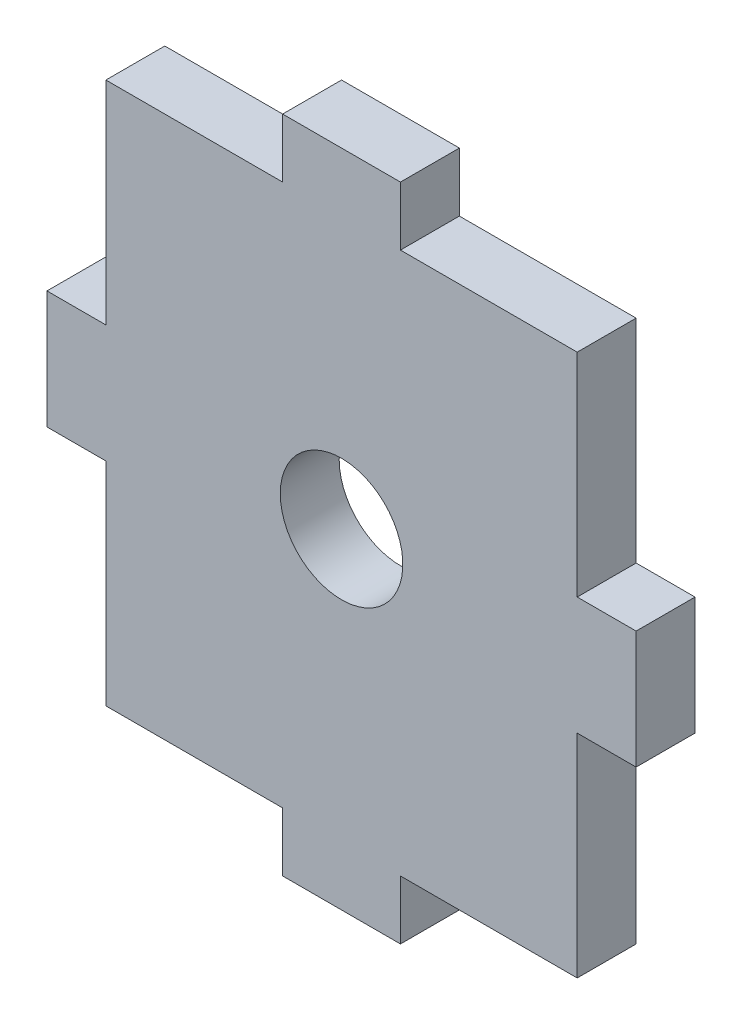
ISO-10303-21;
HEADER;
FILE_DESCRIPTION(('STEP AP214'),'2;1');
FILE_NAME('part.step','',(''),(''),'','','');
FILE_SCHEMA(('AUTOMOTIVE_DESIGN { 1 0 10303 214 1 1 1 1 }'));
ENDSEC;
DATA;
#1=APPLICATION_CONTEXT('core data for automotive mechanical design processes');
#2=APPLICATION_PROTOCOL_DEFINITION('international standard','automotive_design',2000,#1);
#3=PRODUCT_CONTEXT('',#1,'mechanical');
#4=PRODUCT('Part','Part','',(#3));
#5=PRODUCT_RELATED_PRODUCT_CATEGORY('part','',(#4));
#6=PRODUCT_DEFINITION_FORMATION('','',#4);
#7=PRODUCT_DEFINITION_CONTEXT('part definition',#1,'design');
#8=PRODUCT_DEFINITION('design','',#6,#7);
#9=PRODUCT_DEFINITION_SHAPE('','',#8);
#10=(LENGTH_UNIT() NAMED_UNIT(*) SI_UNIT(.MILLI.,.METRE.));
#11=(NAMED_UNIT(*) PLANE_ANGLE_UNIT() SI_UNIT($,.RADIAN.));
#12=(NAMED_UNIT(*) SI_UNIT($,.STERADIAN.) SOLID_ANGLE_UNIT());
#13=UNCERTAINTY_MEASURE_WITH_UNIT(LENGTH_MEASURE(1.E-05),#10,'distance_accuracy_value','');
#14=(GEOMETRIC_REPRESENTATION_CONTEXT(3) GLOBAL_UNCERTAINTY_ASSIGNED_CONTEXT((#13)) GLOBAL_UNIT_ASSIGNED_CONTEXT((#10,
#11,#12)) REPRESENTATION_CONTEXT('',''));
#15=CARTESIAN_POINT('',(0.,0.,0.));
#16=DIRECTION('',(0.,0.,1.));
#17=DIRECTION('',(1.,0.,0.));
#18=AXIS2_PLACEMENT_3D('',#15,#16,#17);
#19=CARTESIAN_POINT('',(-12.7,14.605,3.175));
#20=DIRECTION('',(1.,0.,0.));
#21=DIRECTION('',(0.,0.,-1.));
#22=AXIS2_PLACEMENT_3D('',#19,#20,#21);
#23=PLANE('',#22);
#24=DIRECTION('',(0.,-1.,0.));
#25=VECTOR('',#24,1.);
#26=CARTESIAN_POINT('',(-12.7,14.605,0.));
#27=LINE('',#26,#25);
#28=CARTESIAN_POINT('',(-12.7,14.605,0.));
#29=VERTEX_POINT('',#28);
#30=CARTESIAN_POINT('',(-12.7,3.175,0.));
#31=VERTEX_POINT('',#30);
#32=EDGE_CURVE('E200',#29,#31,#27,.T.);
#33=ORIENTED_EDGE('',*,*,#32,.T.);
#34=DIRECTION('',(0.,0.,-1.));
#35=VECTOR('',#34,1.);
#36=CARTESIAN_POINT('',(-12.7,3.175,3.175));
#37=LINE('',#36,#35);
#38=CARTESIAN_POINT('',(-12.7,3.175,3.175));
#39=VERTEX_POINT('',#38);
#40=EDGE_CURVE('E11',#39,#31,#37,.T.);
#41=ORIENTED_EDGE('',*,*,#40,.F.);
#42=DIRECTION('',(0.,-1.,0.));
#43=VECTOR('',#42,1.);
#44=CARTESIAN_POINT('',(-12.7,14.605,3.175));
#45=LINE('',#44,#43);
#46=CARTESIAN_POINT('',(-12.7,14.605,3.175));
#47=VERTEX_POINT('',#46);
#48=EDGE_CURVE('E239',#47,#39,#45,.T.);
#49=ORIENTED_EDGE('',*,*,#48,.F.);
#50=DIRECTION('',(0.,0.,-1.));
#51=VECTOR('',#50,1.);
#52=CARTESIAN_POINT('',(-12.7,14.605,3.175));
#53=LINE('',#52,#51);
#54=EDGE_CURVE('E196',#47,#29,#53,.T.);
#55=ORIENTED_EDGE('',*,*,#54,.T.);
#56=EDGE_LOOP('',(#33,#41,#49,#55));
#57=FACE_BOUND('',#56,.T.);
#58=ADVANCED_FACE('F32',(#57),#23,.F.);
#59=CARTESIAN_POINT('',(-12.7,3.175,3.175));
#60=DIRECTION('',(0.,-1.,0.));
#61=DIRECTION('',(1.,0.,0.));
#62=AXIS2_PLACEMENT_3D('',#59,#60,#61);
#63=PLANE('',#62);
#64=DIRECTION('',(-1.,0.,0.));
#65=VECTOR('',#64,1.);
#66=CARTESIAN_POINT('',(-12.7,3.175,0.));
#67=LINE('',#66,#65);
#68=CARTESIAN_POINT('',(-15.875,3.175,0.));
#69=VERTEX_POINT('',#68);
#70=EDGE_CURVE('E203',#31,#69,#67,.T.);
#71=ORIENTED_EDGE('',*,*,#70,.T.);
#72=DIRECTION('',(0.,0.,-1.));
#73=VECTOR('',#72,1.);
#74=CARTESIAN_POINT('',(-15.875,3.175,3.175));
#75=LINE('',#74,#73);
#76=CARTESIAN_POINT('',(-15.875,3.175,3.175));
#77=VERTEX_POINT('',#76);
#78=EDGE_CURVE('E40',#77,#69,#75,.T.);
#79=ORIENTED_EDGE('',*,*,#78,.F.);
#80=DIRECTION('',(-1.,0.,0.));
#81=VECTOR('',#80,1.);
#82=CARTESIAN_POINT('',(-12.7,3.175,3.175));
#83=LINE('',#82,#81);
#84=EDGE_CURVE('E127',#39,#77,#83,.T.);
#85=ORIENTED_EDGE('',*,*,#84,.F.);
#86=ORIENTED_EDGE('',*,*,#40,.T.);
#87=EDGE_LOOP('',(#71,#79,#85,#86));
#88=FACE_BOUND('',#87,.T.);
#89=ADVANCED_FACE('F358',(#88),#63,.F.);
#90=CARTESIAN_POINT('',(-15.875,3.175,3.175));
#91=DIRECTION('',(1.,0.,0.));
#92=DIRECTION('',(0.,0.,-1.));
#93=AXIS2_PLACEMENT_3D('',#90,#91,#92);
#94=PLANE('',#93);
#95=DIRECTION('',(0.,-1.,0.));
#96=VECTOR('',#95,1.);
#97=CARTESIAN_POINT('',(-15.875,3.175,0.));
#98=LINE('',#97,#96);
#99=CARTESIAN_POINT('',(-15.875,-3.175,0.));
#100=VERTEX_POINT('',#99);
#101=EDGE_CURVE('E206',#69,#100,#98,.T.);
#102=ORIENTED_EDGE('',*,*,#101,.T.);
#103=DIRECTION('',(0.,0.,-1.));
#104=VECTOR('',#103,1.);
#105=CARTESIAN_POINT('',(-15.875,-3.175,3.175));
#106=LINE('',#105,#104);
#107=CARTESIAN_POINT('',(-15.875,-3.175,3.175));
#108=VERTEX_POINT('',#107);
#109=EDGE_CURVE('E282',#108,#100,#106,.T.);
#110=ORIENTED_EDGE('',*,*,#109,.F.);
#111=DIRECTION('',(0.,-1.,0.));
#112=VECTOR('',#111,1.);
#113=CARTESIAN_POINT('',(-15.875,3.175,3.175));
#114=LINE('',#113,#112);
#115=EDGE_CURVE('E290',#77,#108,#114,.T.);
#116=ORIENTED_EDGE('',*,*,#115,.F.);
#117=ORIENTED_EDGE('',*,*,#78,.T.);
#118=EDGE_LOOP('',(#102,#110,#116,#117));
#119=FACE_BOUND('',#118,.T.);
#120=ADVANCED_FACE('F288',(#119),#94,.F.);
#121=CARTESIAN_POINT('',(-12.7,-3.175,3.175));
#122=DIRECTION('',(0.,1.,0.));
#123=DIRECTION('',(-1.,0.,0.));
#124=AXIS2_PLACEMENT_3D('',#121,#122,#123);
#125=PLANE('',#124);
#126=DIRECTION('',(1.,0.,0.));
#127=VECTOR('',#126,1.);
#128=CARTESIAN_POINT('',(-12.7,-3.175,0.));
#129=LINE('',#128,#127);
#130=CARTESIAN_POINT('',(-12.7,-3.175,0.));
#131=VERTEX_POINT('',#130);
#132=EDGE_CURVE('E208',#100,#131,#129,.T.);
#133=ORIENTED_EDGE('',*,*,#132,.T.);
#134=DIRECTION('',(0.,0.,-1.));
#135=VECTOR('',#134,1.);
#136=CARTESIAN_POINT('',(-12.7,-3.175,3.175));
#137=LINE('',#136,#135);
#138=CARTESIAN_POINT('',(-12.7,-3.175,3.175));
#139=VERTEX_POINT('',#138);
#140=EDGE_CURVE('E279',#139,#131,#137,.T.);
#141=ORIENTED_EDGE('',*,*,#140,.F.);
#142=DIRECTION('',(1.,0.,0.));
#143=VECTOR('',#142,1.);
#144=CARTESIAN_POINT('',(-12.7,-3.175,3.175));
#145=LINE('',#144,#143);
#146=EDGE_CURVE('E308',#108,#139,#145,.T.);
#147=ORIENTED_EDGE('',*,*,#146,.F.);
#148=ORIENTED_EDGE('',*,*,#109,.T.);
#149=EDGE_LOOP('',(#133,#141,#147,#148));
#150=FACE_BOUND('',#149,.T.);
#151=ADVANCED_FACE('F299',(#150),#125,.F.);
#152=CARTESIAN_POINT('',(-12.7,-14.605,3.175));
#153=DIRECTION('',(1.,0.,0.));
#154=DIRECTION('',(0.,0.,-1.));
#155=AXIS2_PLACEMENT_3D('',#152,#153,#154);
#156=PLANE('',#155);
#157=DIRECTION('',(0.,-1.,0.));
#158=VECTOR('',#157,1.);
#159=CARTESIAN_POINT('',(-12.7,-14.605,0.));
#160=LINE('',#159,#158);
#161=CARTESIAN_POINT('',(-12.7,-14.605,0.));
#162=VERTEX_POINT('',#161);
#163=EDGE_CURVE('E210',#131,#162,#160,.T.);
#164=ORIENTED_EDGE('',*,*,#163,.T.);
#165=DIRECTION('',(0.,0.,-1.));
#166=VECTOR('',#165,1.);
#167=CARTESIAN_POINT('',(-12.7,-14.605,3.175));
#168=LINE('',#167,#166);
#169=CARTESIAN_POINT('',(-12.7,-14.605,3.175));
#170=VERTEX_POINT('',#169);
#171=EDGE_CURVE('E276',#170,#162,#168,.T.);
#172=ORIENTED_EDGE('',*,*,#171,.F.);
#173=DIRECTION('',(0.,-1.,0.));
#174=VECTOR('',#173,1.);
#175=CARTESIAN_POINT('',(-12.7,-14.605,3.175));
#176=LINE('',#175,#174);
#177=EDGE_CURVE('E305',#139,#170,#176,.T.);
#178=ORIENTED_EDGE('',*,*,#177,.F.);
#179=ORIENTED_EDGE('',*,*,#140,.T.);
#180=EDGE_LOOP('',(#164,#172,#178,#179));
#181=FACE_BOUND('',#180,.T.);
#182=ADVANCED_FACE('F303',(#181),#156,.F.);
#183=CARTESIAN_POINT('',(-12.7,-14.605,3.175));
#184=DIRECTION('',(0.,1.,0.));
#185=DIRECTION('',(0.,0.,1.));
#186=AXIS2_PLACEMENT_3D('',#183,#184,#185);
#187=PLANE('',#186);
#188=DIRECTION('',(1.,0.,0.));
#189=VECTOR('',#188,1.);
#190=CARTESIAN_POINT('',(-12.7,-14.605,0.));
#191=LINE('',#190,#189);
#192=CARTESIAN_POINT('',(-3.175,-14.605,0.));
#193=VERTEX_POINT('',#192);
#194=EDGE_CURVE('E212',#162,#193,#191,.T.);
#195=ORIENTED_EDGE('',*,*,#194,.T.);
#196=DIRECTION('',(0.,0.,-1.));
#197=VECTOR('',#196,1.);
#198=CARTESIAN_POINT('',(-3.175,-14.605,3.175));
#199=LINE('',#198,#197);
#200=CARTESIAN_POINT('',(-3.175,-14.605,3.175));
#201=VERTEX_POINT('',#200);
#202=EDGE_CURVE('E273',#201,#193,#199,.T.);
#203=ORIENTED_EDGE('',*,*,#202,.F.);
#204=DIRECTION('',(1.,0.,0.));
#205=VECTOR('',#204,1.);
#206=CARTESIAN_POINT('',(-12.7,-14.605,3.175));
#207=LINE('',#206,#205);
#208=EDGE_CURVE('E307',#170,#201,#207,.T.);
#209=ORIENTED_EDGE('',*,*,#208,.F.);
#210=ORIENTED_EDGE('',*,*,#171,.T.);
#211=EDGE_LOOP('',(#195,#203,#209,#210));
#212=FACE_BOUND('',#211,.T.);
#213=ADVANCED_FACE('F371',(#212),#187,.F.);
#214=CARTESIAN_POINT('',(-3.175,-17.78,3.175));
#215=DIRECTION('',(1.,0.,0.));
#216=DIRECTION('',(0.,1.,0.));
#217=AXIS2_PLACEMENT_3D('',#214,#215,#216);
#218=PLANE('',#217);
#219=DIRECTION('',(0.,-1.,0.));
#220=VECTOR('',#219,1.);
#221=CARTESIAN_POINT('',(-3.175,-17.78,0.));
#222=LINE('',#221,#220);
#223=CARTESIAN_POINT('',(-3.175,-17.78,0.));
#224=VERTEX_POINT('',#223);
#225=EDGE_CURVE('E214',#193,#224,#222,.T.);
#226=ORIENTED_EDGE('',*,*,#225,.T.);
#227=DIRECTION('',(0.,0.,-1.));
#228=VECTOR('',#227,1.);
#229=CARTESIAN_POINT('',(-3.175,-17.78,3.175));
#230=LINE('',#229,#228);
#231=CARTESIAN_POINT('',(-3.175,-17.78,3.175));
#232=VERTEX_POINT('',#231);
#233=EDGE_CURVE('E270',#232,#224,#230,.T.);
#234=ORIENTED_EDGE('',*,*,#233,.F.);
#235=DIRECTION('',(0.,-1.,0.));
#236=VECTOR('',#235,1.);
#237=CARTESIAN_POINT('',(-3.175,-17.78,3.175));
#238=LINE('',#237,#236);
#239=EDGE_CURVE('E310',#201,#232,#238,.T.);
#240=ORIENTED_EDGE('',*,*,#239,.F.);
#241=ORIENTED_EDGE('',*,*,#202,.T.);
#242=EDGE_LOOP('',(#226,#234,#240,#241));
#243=FACE_BOUND('',#242,.T.);
#244=ADVANCED_FACE('F374',(#243),#218,.F.);
#245=CARTESIAN_POINT('',(-3.175,-17.78,3.175));
#246=DIRECTION('',(0.,1.,0.));
#247=DIRECTION('',(0.,0.,1.));
#248=AXIS2_PLACEMENT_3D('',#245,#246,#247);
#249=PLANE('',#248);
#250=DIRECTION('',(1.,0.,0.));
#251=VECTOR('',#250,1.);
#252=CARTESIAN_POINT('',(-3.175,-17.78,0.));
#253=LINE('',#252,#251);
#254=CARTESIAN_POINT('',(3.175,-17.78,0.));
#255=VERTEX_POINT('',#254);
#256=EDGE_CURVE('E216',#224,#255,#253,.T.);
#257=ORIENTED_EDGE('',*,*,#256,.T.);
#258=DIRECTION('',(0.,0.,-1.));
#259=VECTOR('',#258,1.);
#260=CARTESIAN_POINT('',(3.175,-17.78,3.175));
#261=LINE('',#260,#259);
#262=CARTESIAN_POINT('',(3.175,-17.78,3.175));
#263=VERTEX_POINT('',#262);
#264=EDGE_CURVE('E267',#263,#255,#261,.T.);
#265=ORIENTED_EDGE('',*,*,#264,.F.);
#266=DIRECTION('',(1.,0.,0.));
#267=VECTOR('',#266,1.);
#268=CARTESIAN_POINT('',(-3.175,-17.78,3.175));
#269=LINE('',#268,#267);
#270=EDGE_CURVE('E316',#232,#263,#269,.T.);
#271=ORIENTED_EDGE('',*,*,#270,.F.);
#272=ORIENTED_EDGE('',*,*,#233,.T.);
#273=EDGE_LOOP('',(#257,#265,#271,#272));
#274=FACE_BOUND('',#273,.T.);
#275=ADVANCED_FACE('F378',(#274),#249,.F.);
#276=CARTESIAN_POINT('',(3.175,-17.78,3.175));
#277=DIRECTION('',(-1.,0.,0.));
#278=DIRECTION('',(0.,-1.,0.));
#279=AXIS2_PLACEMENT_3D('',#276,#277,#278);
#280=PLANE('',#279);
#281=DIRECTION('',(0.,1.,0.));
#282=VECTOR('',#281,1.);
#283=CARTESIAN_POINT('',(3.175,-17.78,0.));
#284=LINE('',#283,#282);
#285=CARTESIAN_POINT('',(3.175,-14.605,0.));
#286=VERTEX_POINT('',#285);
#287=EDGE_CURVE('E218',#255,#286,#284,.T.);
#288=ORIENTED_EDGE('',*,*,#287,.T.);
#289=DIRECTION('',(0.,0.,-1.));
#290=VECTOR('',#289,1.);
#291=CARTESIAN_POINT('',(3.175,-14.605,3.175));
#292=LINE('',#291,#290);
#293=CARTESIAN_POINT('',(3.175,-14.605,3.175));
#294=VERTEX_POINT('',#293);
#295=EDGE_CURVE('E264',#294,#286,#292,.T.);
#296=ORIENTED_EDGE('',*,*,#295,.F.);
#297=DIRECTION('',(0.,1.,0.));
#298=VECTOR('',#297,1.);
#299=CARTESIAN_POINT('',(3.175,-17.78,3.175));
#300=LINE('',#299,#298);
#301=EDGE_CURVE('E318',#263,#294,#300,.T.);
#302=ORIENTED_EDGE('',*,*,#301,.F.);
#303=ORIENTED_EDGE('',*,*,#264,.T.);
#304=EDGE_LOOP('',(#288,#296,#302,#303));
#305=FACE_BOUND('',#304,.T.);
#306=ADVANCED_FACE('F382',(#305),#280,.F.);
#307=CARTESIAN_POINT('',(12.7,-14.605,3.175));
#308=DIRECTION('',(0.,1.,0.));
#309=DIRECTION('',(0.,0.,1.));
#310=AXIS2_PLACEMENT_3D('',#307,#308,#309);
#311=PLANE('',#310);
#312=DIRECTION('',(1.,0.,0.));
#313=VECTOR('',#312,1.);
#314=CARTESIAN_POINT('',(12.7,-14.605,0.));
#315=LINE('',#314,#313);
#316=CARTESIAN_POINT('',(12.7,-14.605,0.));
#317=VERTEX_POINT('',#316);
#318=EDGE_CURVE('E220',#286,#317,#315,.T.);
#319=ORIENTED_EDGE('',*,*,#318,.T.);
#320=DIRECTION('',(0.,0.,-1.));
#321=VECTOR('',#320,1.);
#322=CARTESIAN_POINT('',(12.7,-14.605,3.175));
#323=LINE('',#322,#321);
#324=CARTESIAN_POINT('',(12.7,-14.605,3.175));
#325=VERTEX_POINT('',#324);
#326=EDGE_CURVE('E261',#325,#317,#323,.T.);
#327=ORIENTED_EDGE('',*,*,#326,.F.);
#328=DIRECTION('',(1.,0.,0.));
#329=VECTOR('',#328,1.);
#330=CARTESIAN_POINT('',(12.7,-14.605,3.175));
#331=LINE('',#330,#329);
#332=EDGE_CURVE('E320',#294,#325,#331,.T.);
#333=ORIENTED_EDGE('',*,*,#332,.F.);
#334=ORIENTED_EDGE('',*,*,#295,.T.);
#335=EDGE_LOOP('',(#319,#327,#333,#334));
#336=FACE_BOUND('',#335,.T.);
#337=ADVANCED_FACE('F386',(#336),#311,.F.);
#338=CARTESIAN_POINT('',(12.7,-14.605,3.175));
#339=DIRECTION('',(-1.,0.,0.));
#340=DIRECTION('',(0.,0.,1.));
#341=AXIS2_PLACEMENT_3D('',#338,#339,#340);
#342=PLANE('',#341);
#343=DIRECTION('',(0.,1.,0.));
#344=VECTOR('',#343,1.);
#345=CARTESIAN_POINT('',(12.7,-14.605,0.));
#346=LINE('',#345,#344);
#347=CARTESIAN_POINT('',(12.7,-3.175,0.));
#348=VERTEX_POINT('',#347);
#349=EDGE_CURVE('E222',#317,#348,#346,.T.);
#350=ORIENTED_EDGE('',*,*,#349,.T.);
#351=DIRECTION('',(0.,0.,-1.));
#352=VECTOR('',#351,1.);
#353=CARTESIAN_POINT('',(12.7,-3.175,3.175));
#354=LINE('',#353,#352);
#355=CARTESIAN_POINT('',(12.7,-3.175,3.175));
#356=VERTEX_POINT('',#355);
#357=EDGE_CURVE('E258',#356,#348,#354,.T.);
#358=ORIENTED_EDGE('',*,*,#357,.F.);
#359=DIRECTION('',(0.,1.,0.));
#360=VECTOR('',#359,1.);
#361=CARTESIAN_POINT('',(12.7,-14.605,3.175));
#362=LINE('',#361,#360);
#363=EDGE_CURVE('E322',#325,#356,#362,.T.);
#364=ORIENTED_EDGE('',*,*,#363,.F.);
#365=ORIENTED_EDGE('',*,*,#326,.T.);
#366=EDGE_LOOP('',(#350,#358,#364,#365));
#367=FACE_BOUND('',#366,.T.);
#368=ADVANCED_FACE('F390',(#367),#342,.F.);
#369=CARTESIAN_POINT('',(12.7,-3.175,3.175));
#370=DIRECTION('',(0.,1.,0.));
#371=DIRECTION('',(-1.,0.,0.));
#372=AXIS2_PLACEMENT_3D('',#369,#370,#371);
#373=PLANE('',#372);
#374=DIRECTION('',(1.,0.,0.));
#375=VECTOR('',#374,1.);
#376=CARTESIAN_POINT('',(12.7,-3.175,0.));
#377=LINE('',#376,#375);
#378=CARTESIAN_POINT('',(15.875,-3.175,0.));
#379=VERTEX_POINT('',#378);
#380=EDGE_CURVE('E224',#348,#379,#377,.T.);
#381=ORIENTED_EDGE('',*,*,#380,.T.);
#382=DIRECTION('',(0.,0.,-1.));
#383=VECTOR('',#382,1.);
#384=CARTESIAN_POINT('',(15.875,-3.175,3.175));
#385=LINE('',#384,#383);
#386=CARTESIAN_POINT('',(15.875,-3.175,3.175));
#387=VERTEX_POINT('',#386);
#388=EDGE_CURVE('E255',#387,#379,#385,.T.);
#389=ORIENTED_EDGE('',*,*,#388,.F.);
#390=DIRECTION('',(1.,0.,0.));
#391=VECTOR('',#390,1.);
#392=CARTESIAN_POINT('',(12.7,-3.175,3.175));
#393=LINE('',#392,#391);
#394=EDGE_CURVE('E324',#356,#387,#393,.T.);
#395=ORIENTED_EDGE('',*,*,#394,.F.);
#396=ORIENTED_EDGE('',*,*,#357,.T.);
#397=EDGE_LOOP('',(#381,#389,#395,#396));
#398=FACE_BOUND('',#397,.T.);
#399=ADVANCED_FACE('F394',(#398),#373,.F.);
#400=CARTESIAN_POINT('',(15.875,3.175,3.175));
#401=DIRECTION('',(-1.,0.,0.));
#402=DIRECTION('',(0.,0.,1.));
#403=AXIS2_PLACEMENT_3D('',#400,#401,#402);
#404=PLANE('',#403);
#405=DIRECTION('',(0.,1.,0.));
#406=VECTOR('',#405,1.);
#407=CARTESIAN_POINT('',(15.875,3.175,0.));
#408=LINE('',#407,#406);
#409=CARTESIAN_POINT('',(15.875,3.175,0.));
#410=VERTEX_POINT('',#409);
#411=EDGE_CURVE('E226',#379,#410,#408,.T.);
#412=ORIENTED_EDGE('',*,*,#411,.T.);
#413=DIRECTION('',(0.,0.,-1.));
#414=VECTOR('',#413,1.);
#415=CARTESIAN_POINT('',(15.875,3.175,3.175));
#416=LINE('',#415,#414);
#417=CARTESIAN_POINT('',(15.875,3.175,3.175));
#418=VERTEX_POINT('',#417);
#419=EDGE_CURVE('E252',#418,#410,#416,.T.);
#420=ORIENTED_EDGE('',*,*,#419,.F.);
#421=DIRECTION('',(0.,1.,0.));
#422=VECTOR('',#421,1.);
#423=CARTESIAN_POINT('',(15.875,3.175,3.175));
#424=LINE('',#423,#422);
#425=EDGE_CURVE('E326',#387,#418,#424,.T.);
#426=ORIENTED_EDGE('',*,*,#425,.F.);
#427=ORIENTED_EDGE('',*,*,#388,.T.);
#428=EDGE_LOOP('',(#412,#420,#426,#427));
#429=FACE_BOUND('',#428,.T.);
#430=ADVANCED_FACE('F398',(#429),#404,.F.);
#431=CARTESIAN_POINT('',(12.7,3.175,3.175));
#432=DIRECTION('',(0.,-1.,0.));
#433=DIRECTION('',(1.,0.,0.));
#434=AXIS2_PLACEMENT_3D('',#431,#432,#433);
#435=PLANE('',#434);
#436=DIRECTION('',(-1.,0.,0.));
#437=VECTOR('',#436,1.);
#438=CARTESIAN_POINT('',(12.7,3.175,0.));
#439=LINE('',#438,#437);
#440=CARTESIAN_POINT('',(12.7,3.175,0.));
#441=VERTEX_POINT('',#440);
#442=EDGE_CURVE('E228',#410,#441,#439,.T.);
#443=ORIENTED_EDGE('',*,*,#442,.T.);
#444=DIRECTION('',(0.,0.,-1.));
#445=VECTOR('',#444,1.);
#446=CARTESIAN_POINT('',(12.7,3.175,3.175));
#447=LINE('',#446,#445);
#448=CARTESIAN_POINT('',(12.7,3.175,3.175));
#449=VERTEX_POINT('',#448);
#450=EDGE_CURVE('E249',#449,#441,#447,.T.);
#451=ORIENTED_EDGE('',*,*,#450,.F.);
#452=DIRECTION('',(-1.,0.,0.));
#453=VECTOR('',#452,1.);
#454=CARTESIAN_POINT('',(12.7,3.175,3.175));
#455=LINE('',#454,#453);
#456=EDGE_CURVE('E328',#418,#449,#455,.T.);
#457=ORIENTED_EDGE('',*,*,#456,.F.);
#458=ORIENTED_EDGE('',*,*,#419,.T.);
#459=EDGE_LOOP('',(#443,#451,#457,#458));
#460=FACE_BOUND('',#459,.T.);
#461=ADVANCED_FACE('F402',(#460),#435,.F.);
#462=CARTESIAN_POINT('',(12.7,14.605,3.175));
#463=DIRECTION('',(-1.,0.,0.));
#464=DIRECTION('',(0.,0.,1.));
#465=AXIS2_PLACEMENT_3D('',#462,#463,#464);
#466=PLANE('',#465);
#467=DIRECTION('',(0.,1.,0.));
#468=VECTOR('',#467,1.);
#469=CARTESIAN_POINT('',(12.7,14.605,0.));
#470=LINE('',#469,#468);
#471=CARTESIAN_POINT('',(12.7,14.605,0.));
#472=VERTEX_POINT('',#471);
#473=EDGE_CURVE('E230',#441,#472,#470,.T.);
#474=ORIENTED_EDGE('',*,*,#473,.T.);
#475=DIRECTION('',(0.,0.,-1.));
#476=VECTOR('',#475,1.);
#477=CARTESIAN_POINT('',(12.7,14.605,3.175));
#478=LINE('',#477,#476);
#479=CARTESIAN_POINT('',(12.7,14.605,3.175));
#480=VERTEX_POINT('',#479);
#481=EDGE_CURVE('E246',#480,#472,#478,.T.);
#482=ORIENTED_EDGE('',*,*,#481,.F.);
#483=DIRECTION('',(0.,1.,0.));
#484=VECTOR('',#483,1.);
#485=CARTESIAN_POINT('',(12.7,14.605,3.175));
#486=LINE('',#485,#484);
#487=EDGE_CURVE('E330',#449,#480,#486,.T.);
#488=ORIENTED_EDGE('',*,*,#487,.F.);
#489=ORIENTED_EDGE('',*,*,#450,.T.);
#490=EDGE_LOOP('',(#474,#482,#488,#489));
#491=FACE_BOUND('',#490,.T.);
#492=ADVANCED_FACE('F406',(#491),#466,.F.);
#493=CARTESIAN_POINT('',(12.7,14.605,3.175));
#494=DIRECTION('',(0.,-1.,0.));
#495=DIRECTION('',(0.,0.,-1.));
#496=AXIS2_PLACEMENT_3D('',#493,#494,#495);
#497=PLANE('',#496);
#498=DIRECTION('',(-1.,0.,0.));
#499=VECTOR('',#498,1.);
#500=CARTESIAN_POINT('',(12.7,14.605,0.));
#501=LINE('',#500,#499);
#502=CARTESIAN_POINT('',(3.175,14.605,0.));
#503=VERTEX_POINT('',#502);
#504=EDGE_CURVE('E232',#472,#503,#501,.T.);
#505=ORIENTED_EDGE('',*,*,#504,.T.);
#506=DIRECTION('',(0.,0.,-1.));
#507=VECTOR('',#506,1.);
#508=CARTESIAN_POINT('',(3.175,14.605,3.175));
#509=LINE('',#508,#507);
#510=CARTESIAN_POINT('',(3.175,14.605,3.175));
#511=VERTEX_POINT('',#510);
#512=EDGE_CURVE('E243',#511,#503,#509,.T.);
#513=ORIENTED_EDGE('',*,*,#512,.F.);
#514=DIRECTION('',(-1.,0.,0.));
#515=VECTOR('',#514,1.);
#516=CARTESIAN_POINT('',(12.7,14.605,3.175));
#517=LINE('',#516,#515);
#518=EDGE_CURVE('E332',#480,#511,#517,.T.);
#519=ORIENTED_EDGE('',*,*,#518,.F.);
#520=ORIENTED_EDGE('',*,*,#481,.T.);
#521=EDGE_LOOP('',(#505,#513,#519,#520));
#522=FACE_BOUND('',#521,.T.);
#523=ADVANCED_FACE('F338',(#522),#497,.F.);
#524=CARTESIAN_POINT('',(3.175,17.78,3.175));
#525=DIRECTION('',(-1.,0.,0.));
#526=DIRECTION('',(0.,-1.,0.));
#527=AXIS2_PLACEMENT_3D('',#524,#525,#526);
#528=PLANE('',#527);
#529=DIRECTION('',(0.,1.,0.));
#530=VECTOR('',#529,1.);
#531=CARTESIAN_POINT('',(3.175,17.78,0.));
#532=LINE('',#531,#530);
#533=CARTESIAN_POINT('',(3.175,17.78,0.));
#534=VERTEX_POINT('',#533);
#535=EDGE_CURVE('E234',#503,#534,#532,.T.);
#536=ORIENTED_EDGE('',*,*,#535,.T.);
#537=DIRECTION('',(0.,0.,-1.));
#538=VECTOR('',#537,1.);
#539=CARTESIAN_POINT('',(3.175,17.78,3.175));
#540=LINE('',#539,#538);
#541=CARTESIAN_POINT('',(3.175,17.78,3.175));
#542=VERTEX_POINT('',#541);
#543=EDGE_CURVE('E191',#542,#534,#540,.T.);
#544=ORIENTED_EDGE('',*,*,#543,.F.);
#545=DIRECTION('',(0.,1.,0.));
#546=VECTOR('',#545,1.);
#547=CARTESIAN_POINT('',(3.175,17.78,3.175));
#548=LINE('',#547,#546);
#549=EDGE_CURVE('E182',#511,#542,#548,.T.);
#550=ORIENTED_EDGE('',*,*,#549,.F.);
#551=ORIENTED_EDGE('',*,*,#512,.T.);
#552=EDGE_LOOP('',(#536,#544,#550,#551));
#553=FACE_BOUND('',#552,.T.);
#554=ADVANCED_FACE('F342',(#553),#528,.F.);
#555=CARTESIAN_POINT('',(-3.175,17.78,3.175));
#556=DIRECTION('',(0.,-1.,0.));
#557=DIRECTION('',(0.,0.,-1.));
#558=AXIS2_PLACEMENT_3D('',#555,#556,#557);
#559=PLANE('',#558);
#560=DIRECTION('',(-1.,0.,0.));
#561=VECTOR('',#560,1.);
#562=CARTESIAN_POINT('',(-3.175,17.78,0.));
#563=LINE('',#562,#561);
#564=CARTESIAN_POINT('',(-3.175,17.78,0.));
#565=VERTEX_POINT('',#564);
#566=EDGE_CURVE('E190',#534,#565,#563,.T.);
#567=ORIENTED_EDGE('',*,*,#566,.T.);
#568=DIRECTION('',(0.,0.,-1.));
#569=VECTOR('',#568,1.);
#570=CARTESIAN_POINT('',(-3.175,17.78,3.175));
#571=LINE('',#570,#569);
#572=CARTESIAN_POINT('',(-3.175,17.78,3.175));
#573=VERTEX_POINT('',#572);
#574=EDGE_CURVE('E187',#573,#565,#571,.T.);
#575=ORIENTED_EDGE('',*,*,#574,.F.);
#576=DIRECTION('',(-1.,0.,0.));
#577=VECTOR('',#576,1.);
#578=CARTESIAN_POINT('',(-3.175,17.78,3.175));
#579=LINE('',#578,#577);
#580=EDGE_CURVE('E176',#542,#573,#579,.T.);
#581=ORIENTED_EDGE('',*,*,#580,.F.);
#582=ORIENTED_EDGE('',*,*,#543,.T.);
#583=EDGE_LOOP('',(#567,#575,#581,#582));
#584=FACE_BOUND('',#583,.T.);
#585=ADVANCED_FACE('F188',(#584),#559,.F.);
#586=CARTESIAN_POINT('',(-3.175,17.78,3.175));
#587=DIRECTION('',(1.,0.,0.));
#588=DIRECTION('',(0.,1.,0.));
#589=AXIS2_PLACEMENT_3D('',#586,#587,#588);
#590=PLANE('',#589);
#591=DIRECTION('',(0.,-1.,0.));
#592=VECTOR('',#591,1.);
#593=CARTESIAN_POINT('',(-3.175,17.78,0.));
#594=LINE('',#593,#592);
#595=CARTESIAN_POINT('',(-3.175,14.605,0.));
#596=VERTEX_POINT('',#595);
#597=EDGE_CURVE('E113',#565,#596,#594,.T.);
#598=ORIENTED_EDGE('',*,*,#597,.T.);
#599=DIRECTION('',(0.,0.,-1.));
#600=VECTOR('',#599,1.);
#601=CARTESIAN_POINT('',(-3.175,14.605,3.175));
#602=LINE('',#601,#600);
#603=CARTESIAN_POINT('',(-3.175,14.605,3.175));
#604=VERTEX_POINT('',#603);
#605=EDGE_CURVE('E192',#604,#596,#602,.T.);
#606=ORIENTED_EDGE('',*,*,#605,.F.);
#607=DIRECTION('',(0.,-1.,0.));
#608=VECTOR('',#607,1.);
#609=CARTESIAN_POINT('',(-3.175,17.78,3.175));
#610=LINE('',#609,#608);
#611=EDGE_CURVE('E180',#573,#604,#610,.T.);
#612=ORIENTED_EDGE('',*,*,#611,.F.);
#613=ORIENTED_EDGE('',*,*,#574,.T.);
#614=EDGE_LOOP('',(#598,#606,#612,#613));
#615=FACE_BOUND('',#614,.T.);
#616=ADVANCED_FACE('F194',(#615),#590,.F.);
#617=CARTESIAN_POINT('',(-12.7,14.605,3.175));
#618=DIRECTION('',(0.,-1.,0.));
#619=DIRECTION('',(0.,0.,-1.));
#620=AXIS2_PLACEMENT_3D('',#617,#618,#619);
#621=PLANE('',#620);
#622=DIRECTION('',(-1.,0.,0.));
#623=VECTOR('',#622,1.);
#624=CARTESIAN_POINT('',(-12.7,14.605,0.));
#625=LINE('',#624,#623);
#626=EDGE_CURVE('E119',#596,#29,#625,.T.);
#627=ORIENTED_EDGE('',*,*,#626,.T.);
#628=ORIENTED_EDGE('',*,*,#54,.F.);
#629=DIRECTION('',(-1.,0.,0.));
#630=VECTOR('',#629,1.);
#631=CARTESIAN_POINT('',(-12.7,14.605,3.175));
#632=LINE('',#631,#630);
#633=EDGE_CURVE('E48',#604,#47,#632,.T.);
#634=ORIENTED_EDGE('',*,*,#633,.F.);
#635=ORIENTED_EDGE('',*,*,#605,.T.);
#636=EDGE_LOOP('',(#627,#628,#634,#635));
#637=FACE_BOUND('',#636,.T.);
#638=ADVANCED_FACE('F346',(#637),#621,.F.);
#639=CARTESIAN_POINT('',(-12.7,-14.605,3.175));
#640=DIRECTION('',(0.,0.,1.));
#641=DIRECTION('',(1.,0.,0.));
#642=AXIS2_PLACEMENT_3D('',#639,#640,#641);
#643=PLANE('',#642);
#644=CARTESIAN_POINT('',(0.,0.,3.175));
#645=DIRECTION('',(0.,0.,-1.));
#646=DIRECTION('',(-1.,0.,0.));
#647=AXIS2_PLACEMENT_3D('',#644,#645,#646);
#648=CIRCLE('',#647,3.302);
#649=CARTESIAN_POINT('',(-3.302,0.,3.175));
#650=VERTEX_POINT('',#649);
#651=EDGE_CURVE('E204',#650,#650,#648,.T.);
#652=ORIENTED_EDGE('',*,*,#651,.T.);
#653=EDGE_LOOP('',(#652));
#654=FACE_BOUND('',#653,.T.);
#655=ORIENTED_EDGE('',*,*,#48,.T.);
#656=ORIENTED_EDGE('',*,*,#84,.T.);
#657=ORIENTED_EDGE('',*,*,#115,.T.);
#658=ORIENTED_EDGE('',*,*,#146,.T.);
#659=ORIENTED_EDGE('',*,*,#177,.T.);
#660=ORIENTED_EDGE('',*,*,#208,.T.);
#661=ORIENTED_EDGE('',*,*,#239,.T.);
#662=ORIENTED_EDGE('',*,*,#270,.T.);
#663=ORIENTED_EDGE('',*,*,#301,.T.);
#664=ORIENTED_EDGE('',*,*,#332,.T.);
#665=ORIENTED_EDGE('',*,*,#363,.T.);
#666=ORIENTED_EDGE('',*,*,#394,.T.);
#667=ORIENTED_EDGE('',*,*,#425,.T.);
#668=ORIENTED_EDGE('',*,*,#456,.T.);
#669=ORIENTED_EDGE('',*,*,#487,.T.);
#670=ORIENTED_EDGE('',*,*,#518,.T.);
#671=ORIENTED_EDGE('',*,*,#549,.T.);
#672=ORIENTED_EDGE('',*,*,#580,.T.);
#673=ORIENTED_EDGE('',*,*,#611,.T.);
#674=ORIENTED_EDGE('',*,*,#633,.T.);
#675=EDGE_LOOP('',(#655,#656,#657,#658,#659,#660,#661,#662,#663,#664,#665,#666,#667,#668,#669,
#670,#671,#672,#673,#674));
#676=FACE_BOUND('',#675,.T.);
#677=ADVANCED_FACE('F178',(#654,#676),#643,.T.);
#678=CARTESIAN_POINT('',(-12.7,-14.605,0.));
#679=DIRECTION('',(0.,0.,1.));
#680=DIRECTION('',(1.,0.,0.));
#681=AXIS2_PLACEMENT_3D('',#678,#679,#680);
#682=PLANE('',#681);
#683=CARTESIAN_POINT('',(0.,0.,0.));
#684=DIRECTION('',(0.,0.,-1.));
#685=DIRECTION('',(-1.,0.,0.));
#686=AXIS2_PLACEMENT_3D('',#683,#684,#685);
#687=CIRCLE('',#686,3.302);
#688=CARTESIAN_POINT('',(-3.302,0.,0.));
#689=VERTEX_POINT('',#688);
#690=EDGE_CURVE('E461',#689,#689,#687,.T.);
#691=ORIENTED_EDGE('',*,*,#690,.F.);
#692=EDGE_LOOP('',(#691));
#693=FACE_BOUND('',#692,.T.);
#694=ORIENTED_EDGE('',*,*,#32,.F.);
#695=ORIENTED_EDGE('',*,*,#626,.F.);
#696=ORIENTED_EDGE('',*,*,#597,.F.);
#697=ORIENTED_EDGE('',*,*,#566,.F.);
#698=ORIENTED_EDGE('',*,*,#535,.F.);
#699=ORIENTED_EDGE('',*,*,#504,.F.);
#700=ORIENTED_EDGE('',*,*,#473,.F.);
#701=ORIENTED_EDGE('',*,*,#442,.F.);
#702=ORIENTED_EDGE('',*,*,#411,.F.);
#703=ORIENTED_EDGE('',*,*,#380,.F.);
#704=ORIENTED_EDGE('',*,*,#349,.F.);
#705=ORIENTED_EDGE('',*,*,#318,.F.);
#706=ORIENTED_EDGE('',*,*,#287,.F.);
#707=ORIENTED_EDGE('',*,*,#256,.F.);
#708=ORIENTED_EDGE('',*,*,#225,.F.);
#709=ORIENTED_EDGE('',*,*,#194,.F.);
#710=ORIENTED_EDGE('',*,*,#163,.F.);
#711=ORIENTED_EDGE('',*,*,#132,.F.);
#712=ORIENTED_EDGE('',*,*,#101,.F.);
#713=ORIENTED_EDGE('',*,*,#70,.F.);
#714=EDGE_LOOP('',(#694,#695,#696,#697,#698,#699,#700,#701,#702,#703,#704,#705,#706,#707,#708,
#709,#710,#711,#712,#713));
#715=FACE_BOUND('',#714,.T.);
#716=ADVANCED_FACE('F294',(#693,#715),#682,.F.);
#717=CARTESIAN_POINT('',(0.,0.,3.175));
#718=DIRECTION('',(0.,0.,-1.));
#719=DIRECTION('',(-1.,0.,0.));
#720=AXIS2_PLACEMENT_3D('',#717,#718,#719);
#721=CYLINDRICAL_SURFACE('',#720,3.302);
#722=ORIENTED_EDGE('',*,*,#651,.F.);
#723=EDGE_LOOP('',(#722));
#724=FACE_BOUND('',#723,.T.);
#725=ORIENTED_EDGE('',*,*,#690,.T.);
#726=EDGE_LOOP('',(#725));
#727=FACE_BOUND('',#726,.T.);
#728=ADVANCED_FACE('F443',(#724,#727),#721,.F.);
#729=CLOSED_SHELL('',(#58,#89,#120,#151,#182,#213,#244,#275,#306,#337,#368,#399,#430,#461,#492,
#523,#554,#585,#616,#638,#677,#716,#728));
#730=MANIFOLD_SOLID_BREP('B2',#729);
#731=ADVANCED_BREP_SHAPE_REPRESENTATION('',(#18,#730),#14);
#732=SHAPE_DEFINITION_REPRESENTATION(#9,#731);
ENDSEC;
END-ISO-10303-21;
